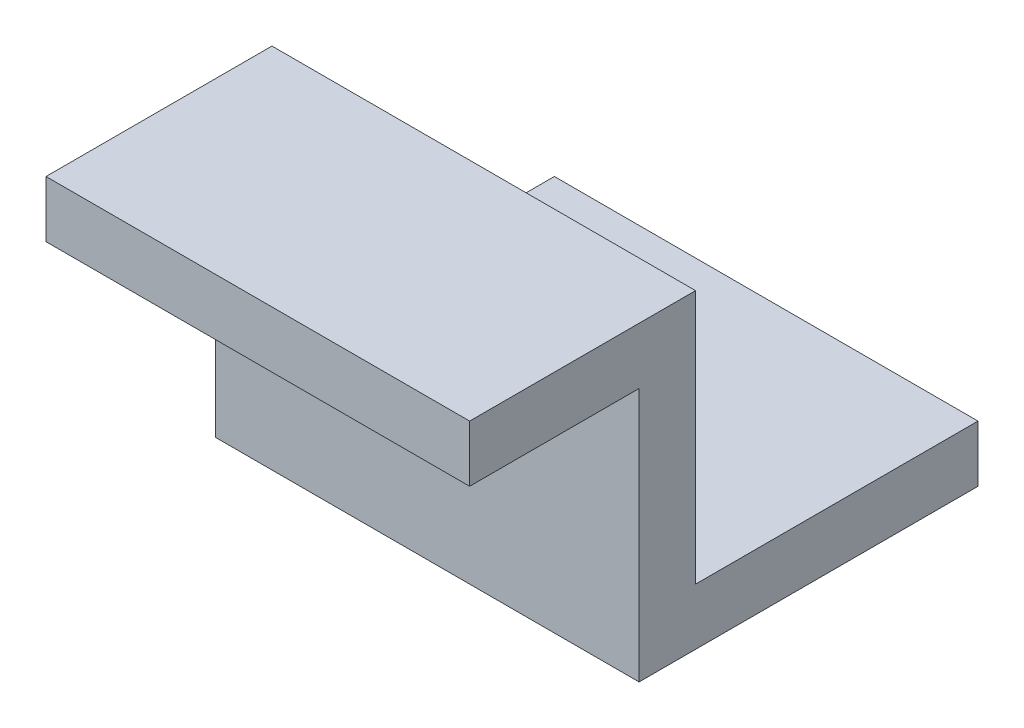
ISO-10303-21;
HEADER;
FILE_DESCRIPTION(('STEP AP214'),'2;1');
FILE_NAME('part.step','',(''),(''),'','','');
FILE_SCHEMA(('AUTOMOTIVE_DESIGN { 1 0 10303 214 1 1 1 1 }'));
ENDSEC;
DATA;
#1=APPLICATION_CONTEXT('core data for automotive mechanical design processes');
#2=APPLICATION_PROTOCOL_DEFINITION('international standard','automotive_design',2000,#1);
#3=PRODUCT_CONTEXT('',#1,'mechanical');
#4=PRODUCT('Part','Part','',(#3));
#5=PRODUCT_RELATED_PRODUCT_CATEGORY('part','',(#4));
#6=PRODUCT_DEFINITION_FORMATION('','',#4);
#7=PRODUCT_DEFINITION_CONTEXT('part definition',#1,'design');
#8=PRODUCT_DEFINITION('design','',#6,#7);
#9=PRODUCT_DEFINITION_SHAPE('','',#8);
#10=(LENGTH_UNIT() NAMED_UNIT(*) SI_UNIT(.MILLI.,.METRE.));
#11=(NAMED_UNIT(*) PLANE_ANGLE_UNIT() SI_UNIT($,.RADIAN.));
#12=(NAMED_UNIT(*) SI_UNIT($,.STERADIAN.) SOLID_ANGLE_UNIT());
#13=UNCERTAINTY_MEASURE_WITH_UNIT(LENGTH_MEASURE(1.E-05),#10,'distance_accuracy_value','');
#14=(GEOMETRIC_REPRESENTATION_CONTEXT(3) GLOBAL_UNCERTAINTY_ASSIGNED_CONTEXT((#13)) GLOBAL_UNIT_ASSIGNED_CONTEXT((#10,
#11,#12)) REPRESENTATION_CONTEXT('',''));
#15=CARTESIAN_POINT('',(0.,0.,0.));
#16=DIRECTION('',(0.,0.,1.));
#17=DIRECTION('',(1.,0.,0.));
#18=AXIS2_PLACEMENT_3D('',#15,#16,#17);
#19=CARTESIAN_POINT('',(-15.,-2.,0.));
#20=DIRECTION('',(0.,0.,1.));
#21=DIRECTION('',(1.,0.,0.));
#22=AXIS2_PLACEMENT_3D('',#19,#20,#21);
#23=PLANE('',#22);
#24=DIRECTION('',(0.,-1.,0.));
#25=VECTOR('',#24,1.);
#26=CARTESIAN_POINT('',(0.,-2.,0.));
#27=LINE('',#26,#25);
#28=CARTESIAN_POINT('',(0.,0.,0.));
#29=VERTEX_POINT('',#28);
#30=CARTESIAN_POINT('',(0.,-2.,0.));
#31=VERTEX_POINT('',#30);
#32=EDGE_CURVE('E130',#29,#31,#27,.T.);
#33=ORIENTED_EDGE('',*,*,#32,.F.);
#34=DIRECTION('',(1.,0.,0.));
#35=VECTOR('',#34,1.);
#36=CARTESIAN_POINT('',(-15.,0.,0.));
#37=LINE('',#36,#35);
#38=CARTESIAN_POINT('',(-15.,0.,0.));
#39=VERTEX_POINT('',#38);
#40=EDGE_CURVE('E11',#39,#29,#37,.T.);
#41=ORIENTED_EDGE('',*,*,#40,.F.);
#42=DIRECTION('',(0.,-1.,0.));
#43=VECTOR('',#42,1.);
#44=CARTESIAN_POINT('',(-15.,-2.,0.));
#45=LINE('',#44,#43);
#46=CARTESIAN_POINT('',(-15.,-2.,0.));
#47=VERTEX_POINT('',#46);
#48=EDGE_CURVE('E151',#39,#47,#45,.T.);
#49=ORIENTED_EDGE('',*,*,#48,.T.);
#50=DIRECTION('',(1.,0.,0.));
#51=VECTOR('',#50,1.);
#52=CARTESIAN_POINT('',(-15.,-2.,0.));
#53=LINE('',#52,#51);
#54=EDGE_CURVE('E36',#47,#31,#53,.T.);
#55=ORIENTED_EDGE('',*,*,#54,.T.);
#56=EDGE_LOOP('',(#33,#41,#49,#55));
#57=FACE_BOUND('',#56,.T.);
#58=ADVANCED_FACE('F33',(#57),#23,.T.);
#59=CARTESIAN_POINT('',(-15.,0.,0.));
#60=DIRECTION('',(0.,1.,0.));
#61=DIRECTION('',(0.,0.,1.));
#62=AXIS2_PLACEMENT_3D('',#59,#60,#61);
#63=PLANE('',#62);
#64=DIRECTION('',(0.,0.,1.));
#65=VECTOR('',#64,1.);
#66=CARTESIAN_POINT('',(0.,0.,0.));
#67=LINE('',#66,#65);
#68=CARTESIAN_POINT('',(0.,0.,-8.));
#69=VERTEX_POINT('',#68);
#70=EDGE_CURVE('E149',#69,#29,#67,.T.);
#71=ORIENTED_EDGE('',*,*,#70,.F.);
#72=DIRECTION('',(1.,0.,0.));
#73=VECTOR('',#72,1.);
#74=CARTESIAN_POINT('',(-15.,0.,-8.));
#75=LINE('',#74,#73);
#76=CARTESIAN_POINT('',(-15.,0.,-8.));
#77=VERTEX_POINT('',#76);
#78=EDGE_CURVE('E42',#77,#69,#75,.T.);
#79=ORIENTED_EDGE('',*,*,#78,.F.);
#80=DIRECTION('',(0.,0.,1.));
#81=VECTOR('',#80,1.);
#82=CARTESIAN_POINT('',(-15.,0.,0.));
#83=LINE('',#82,#81);
#84=EDGE_CURVE('E120',#77,#39,#83,.T.);
#85=ORIENTED_EDGE('',*,*,#84,.T.);
#86=ORIENTED_EDGE('',*,*,#40,.T.);
#87=EDGE_LOOP('',(#71,#79,#85,#86));
#88=FACE_BOUND('',#87,.T.);
#89=ADVANCED_FACE('F163',(#88),#63,.T.);
#90=CARTESIAN_POINT('',(-15.,0.,-8.));
#91=DIRECTION('',(0.,0.,-1.));
#92=DIRECTION('',(0.,1.,0.));
#93=AXIS2_PLACEMENT_3D('',#90,#91,#92);
#94=PLANE('',#93);
#95=DIRECTION('',(0.,1.,0.));
#96=VECTOR('',#95,1.);
#97=CARTESIAN_POINT('',(0.,0.,-8.));
#98=LINE('',#97,#96);
#99=CARTESIAN_POINT('',(0.,-9.,-8.));
#100=VERTEX_POINT('',#99);
#101=EDGE_CURVE('E107',#100,#69,#98,.T.);
#102=ORIENTED_EDGE('',*,*,#101,.F.);
#103=DIRECTION('',(1.,0.,0.));
#104=VECTOR('',#103,1.);
#105=CARTESIAN_POINT('',(-15.,-9.,-8.));
#106=LINE('',#105,#104);
#107=CARTESIAN_POINT('',(-15.,-9.,-8.));
#108=VERTEX_POINT('',#107);
#109=EDGE_CURVE('E102',#108,#100,#106,.T.);
#110=ORIENTED_EDGE('',*,*,#109,.F.);
#111=DIRECTION('',(0.,1.,0.));
#112=VECTOR('',#111,1.);
#113=CARTESIAN_POINT('',(-15.,0.,-8.));
#114=LINE('',#113,#112);
#115=EDGE_CURVE('E105',#108,#77,#114,.T.);
#116=ORIENTED_EDGE('',*,*,#115,.T.);
#117=ORIENTED_EDGE('',*,*,#78,.T.);
#118=EDGE_LOOP('',(#102,#110,#116,#117));
#119=FACE_BOUND('',#118,.T.);
#120=ADVANCED_FACE('F104',(#119),#94,.T.);
#121=CARTESIAN_POINT('',(-15.,-9.,-8.));
#122=DIRECTION('',(0.,1.,0.));
#123=DIRECTION('',(0.,0.,1.));
#124=AXIS2_PLACEMENT_3D('',#121,#122,#123);
#125=PLANE('',#124);
#126=CARTESIAN_POINT('',(-7.5,-9.,-13.));
#127=DIRECTION('',(0.,1.,0.));
#128=DIRECTION('',(0.,0.,1.));
#129=AXIS2_PLACEMENT_3D('',#126,#127,#128);
#130=CIRCLE('',#129,1.5);
#131=CARTESIAN_POINT('',(-7.5,-9.,-11.5));
#132=VERTEX_POINT('',#131);
#133=EDGE_CURVE('E134',#132,#132,#130,.T.);
#134=ORIENTED_EDGE('',*,*,#133,.F.);
#135=EDGE_LOOP('',(#134));
#136=FACE_BOUND('',#135,.T.);
#137=DIRECTION('',(0.,0.,1.));
#138=VECTOR('',#137,1.);
#139=CARTESIAN_POINT('',(0.,-9.,-8.));
#140=LINE('',#139,#138);
#141=CARTESIAN_POINT('',(0.,-9.,-18.));
#142=VERTEX_POINT('',#141);
#143=EDGE_CURVE('E146',#142,#100,#140,.T.);
#144=ORIENTED_EDGE('',*,*,#143,.F.);
#145=DIRECTION('',(1.,0.,0.));
#146=VECTOR('',#145,1.);
#147=CARTESIAN_POINT('',(-15.,-9.,-18.));
#148=LINE('',#147,#146);
#149=CARTESIAN_POINT('',(-15.,-9.,-18.));
#150=VERTEX_POINT('',#149);
#151=EDGE_CURVE('E112',#150,#142,#148,.T.);
#152=ORIENTED_EDGE('',*,*,#151,.F.);
#153=DIRECTION('',(0.,0.,1.));
#154=VECTOR('',#153,1.);
#155=CARTESIAN_POINT('',(-15.,-9.,-8.));
#156=LINE('',#155,#154);
#157=EDGE_CURVE('E118',#150,#108,#156,.T.);
#158=ORIENTED_EDGE('',*,*,#157,.T.);
#159=ORIENTED_EDGE('',*,*,#109,.T.);
#160=EDGE_LOOP('',(#144,#152,#158,#159));
#161=FACE_BOUND('',#160,.T.);
#162=ADVANCED_FACE('F122',(#136,#161),#125,.T.);
#163=CARTESIAN_POINT('',(-15.,-9.,-18.));
#164=DIRECTION('',(0.,0.,-1.));
#165=DIRECTION('',(-1.,0.,0.));
#166=AXIS2_PLACEMENT_3D('',#163,#164,#165);
#167=PLANE('',#166);
#168=DIRECTION('',(0.,1.,0.));
#169=VECTOR('',#168,1.);
#170=CARTESIAN_POINT('',(0.,-9.,-18.));
#171=LINE('',#170,#169);
#172=CARTESIAN_POINT('',(0.,-11.,-18.));
#173=VERTEX_POINT('',#172);
#174=EDGE_CURVE('E143',#173,#142,#171,.T.);
#175=ORIENTED_EDGE('',*,*,#174,.F.);
#176=DIRECTION('',(1.,0.,0.));
#177=VECTOR('',#176,1.);
#178=CARTESIAN_POINT('',(-15.,-11.,-18.));
#179=LINE('',#178,#177);
#180=CARTESIAN_POINT('',(-15.,-11.,-18.));
#181=VERTEX_POINT('',#180);
#182=EDGE_CURVE('E155',#181,#173,#179,.T.);
#183=ORIENTED_EDGE('',*,*,#182,.F.);
#184=DIRECTION('',(0.,1.,0.));
#185=VECTOR('',#184,1.);
#186=CARTESIAN_POINT('',(-15.,-9.,-18.));
#187=LINE('',#186,#185);
#188=EDGE_CURVE('E123',#181,#150,#187,.T.);
#189=ORIENTED_EDGE('',*,*,#188,.T.);
#190=ORIENTED_EDGE('',*,*,#151,.T.);
#191=EDGE_LOOP('',(#175,#183,#189,#190));
#192=FACE_BOUND('',#191,.T.);
#193=ADVANCED_FACE('F176',(#192),#167,.T.);
#194=CARTESIAN_POINT('',(-15.,-11.,-18.));
#195=DIRECTION('',(0.,-1.,0.));
#196=DIRECTION('',(0.,0.,-1.));
#197=AXIS2_PLACEMENT_3D('',#194,#195,#196);
#198=PLANE('',#197);
#199=CARTESIAN_POINT('',(-7.5,-11.,-13.));
#200=DIRECTION('',(0.,-1.,0.));
#201=DIRECTION('',(0.,0.,-1.));
#202=AXIS2_PLACEMENT_3D('',#199,#200,#201);
#203=CIRCLE('',#202,1.5);
#204=CARTESIAN_POINT('',(-7.5,-11.,-14.5));
#205=VERTEX_POINT('',#204);
#206=EDGE_CURVE('E204',#205,#205,#203,.F.);
#207=ORIENTED_EDGE('',*,*,#206,.T.);
#208=EDGE_LOOP('',(#207));
#209=FACE_BOUND('',#208,.T.);
#210=DIRECTION('',(0.,0.,-1.));
#211=VECTOR('',#210,1.);
#212=CARTESIAN_POINT('',(0.,-11.,-18.));
#213=LINE('',#212,#211);
#214=CARTESIAN_POINT('',(0.,-11.,-6.));
#215=VERTEX_POINT('',#214);
#216=EDGE_CURVE('E140',#215,#173,#213,.T.);
#217=ORIENTED_EDGE('',*,*,#216,.F.);
#218=DIRECTION('',(1.,0.,0.));
#219=VECTOR('',#218,1.);
#220=CARTESIAN_POINT('',(-15.,-11.,-6.));
#221=LINE('',#220,#219);
#222=CARTESIAN_POINT('',(-15.,-11.,-6.));
#223=VERTEX_POINT('',#222);
#224=EDGE_CURVE('E157',#223,#215,#221,.T.);
#225=ORIENTED_EDGE('',*,*,#224,.F.);
#226=DIRECTION('',(0.,0.,-1.));
#227=VECTOR('',#226,1.);
#228=CARTESIAN_POINT('',(-15.,-11.,-18.));
#229=LINE('',#228,#227);
#230=EDGE_CURVE('E125',#223,#181,#229,.T.);
#231=ORIENTED_EDGE('',*,*,#230,.T.);
#232=ORIENTED_EDGE('',*,*,#182,.T.);
#233=EDGE_LOOP('',(#217,#225,#231,#232));
#234=FACE_BOUND('',#233,.T.);
#235=ADVANCED_FACE('F180',(#209,#234),#198,.T.);
#236=CARTESIAN_POINT('',(-15.,-11.,-6.));
#237=DIRECTION('',(0.,0.,1.));
#238=DIRECTION('',(1.,0.,0.));
#239=AXIS2_PLACEMENT_3D('',#236,#237,#238);
#240=PLANE('',#239);
#241=DIRECTION('',(0.,-1.,0.));
#242=VECTOR('',#241,1.);
#243=CARTESIAN_POINT('',(0.,-11.,-6.));
#244=LINE('',#243,#242);
#245=CARTESIAN_POINT('',(0.,-2.,-6.));
#246=VERTEX_POINT('',#245);
#247=EDGE_CURVE('E137',#246,#215,#244,.T.);
#248=ORIENTED_EDGE('',*,*,#247,.F.);
#249=DIRECTION('',(1.,0.,0.));
#250=VECTOR('',#249,1.);
#251=CARTESIAN_POINT('',(-15.,-2.,-6.));
#252=LINE('',#251,#250);
#253=CARTESIAN_POINT('',(-15.,-2.,-6.));
#254=VERTEX_POINT('',#253);
#255=EDGE_CURVE('E158',#254,#246,#252,.T.);
#256=ORIENTED_EDGE('',*,*,#255,.F.);
#257=DIRECTION('',(0.,-1.,0.));
#258=VECTOR('',#257,1.);
#259=CARTESIAN_POINT('',(-15.,-11.,-6.));
#260=LINE('',#259,#258);
#261=EDGE_CURVE('E213',#254,#223,#260,.T.);
#262=ORIENTED_EDGE('',*,*,#261,.T.);
#263=ORIENTED_EDGE('',*,*,#224,.T.);
#264=EDGE_LOOP('',(#248,#256,#262,#263));
#265=FACE_BOUND('',#264,.T.);
#266=ADVANCED_FACE('F184',(#265),#240,.T.);
#267=CARTESIAN_POINT('',(-15.,-2.,-6.));
#268=DIRECTION('',(0.,-1.,0.));
#269=DIRECTION('',(0.,0.,-1.));
#270=AXIS2_PLACEMENT_3D('',#267,#268,#269);
#271=PLANE('',#270);
#272=DIRECTION('',(0.,0.,-1.));
#273=VECTOR('',#272,1.);
#274=CARTESIAN_POINT('',(0.,-2.,-6.));
#275=LINE('',#274,#273);
#276=EDGE_CURVE('E133',#31,#246,#275,.T.);
#277=ORIENTED_EDGE('',*,*,#276,.F.);
#278=ORIENTED_EDGE('',*,*,#54,.F.);
#279=DIRECTION('',(0.,0.,-1.));
#280=VECTOR('',#279,1.);
#281=CARTESIAN_POINT('',(-15.,-2.,-6.));
#282=LINE('',#281,#280);
#283=EDGE_CURVE('E211',#47,#254,#282,.T.);
#284=ORIENTED_EDGE('',*,*,#283,.T.);
#285=ORIENTED_EDGE('',*,*,#255,.T.);
#286=EDGE_LOOP('',(#277,#278,#284,#285));
#287=FACE_BOUND('',#286,.T.);
#288=ADVANCED_FACE('F160',(#287),#271,.T.);
#289=CARTESIAN_POINT('',(-15.,0.,0.));
#290=DIRECTION('',(-1.,0.,0.));
#291=DIRECTION('',(0.,0.,1.));
#292=AXIS2_PLACEMENT_3D('',#289,#290,#291);
#293=PLANE('',#292);
#294=ORIENTED_EDGE('',*,*,#48,.F.);
#295=ORIENTED_EDGE('',*,*,#84,.F.);
#296=ORIENTED_EDGE('',*,*,#115,.F.);
#297=ORIENTED_EDGE('',*,*,#157,.F.);
#298=ORIENTED_EDGE('',*,*,#188,.F.);
#299=ORIENTED_EDGE('',*,*,#230,.F.);
#300=ORIENTED_EDGE('',*,*,#261,.F.);
#301=ORIENTED_EDGE('',*,*,#283,.F.);
#302=EDGE_LOOP('',(#294,#295,#296,#297,#298,#299,#300,#301));
#303=FACE_BOUND('',#302,.T.);
#304=ADVANCED_FACE('F116',(#303),#293,.T.);
#305=CARTESIAN_POINT('',(0.,0.,0.));
#306=DIRECTION('',(-1.,0.,0.));
#307=DIRECTION('',(0.,0.,1.));
#308=AXIS2_PLACEMENT_3D('',#305,#306,#307);
#309=PLANE('',#308);
#310=ORIENTED_EDGE('',*,*,#32,.T.);
#311=ORIENTED_EDGE('',*,*,#276,.T.);
#312=ORIENTED_EDGE('',*,*,#247,.T.);
#313=ORIENTED_EDGE('',*,*,#216,.T.);
#314=ORIENTED_EDGE('',*,*,#174,.T.);
#315=ORIENTED_EDGE('',*,*,#143,.T.);
#316=ORIENTED_EDGE('',*,*,#101,.T.);
#317=ORIENTED_EDGE('',*,*,#70,.T.);
#318=EDGE_LOOP('',(#310,#311,#312,#313,#314,#315,#316,#317));
#319=FACE_BOUND('',#318,.T.);
#320=ADVANCED_FACE('F162',(#319),#309,.F.);
#321=CARTESIAN_POINT('',(-7.5,-11.001,-13.));
#322=DIRECTION('',(0.,1.,0.));
#323=DIRECTION('',(0.,0.,1.));
#324=AXIS2_PLACEMENT_3D('',#321,#322,#323);
#325=CYLINDRICAL_SURFACE('',#324,1.5);
#326=ORIENTED_EDGE('',*,*,#206,.F.);
#327=EDGE_LOOP('',(#326));
#328=FACE_BOUND('',#327,.T.);
#329=ORIENTED_EDGE('',*,*,#133,.T.);
#330=EDGE_LOOP('',(#329));
#331=FACE_BOUND('',#330,.T.);
#332=ADVANCED_FACE('F195',(#328,#331),#325,.F.);
#333=CLOSED_SHELL('',(#58,#89,#120,#162,#193,#235,#266,#288,#304,#320,#332));
#334=MANIFOLD_SOLID_BREP('B2',#333);
#335=ADVANCED_BREP_SHAPE_REPRESENTATION('',(#18,#334),#14);
#336=SHAPE_DEFINITION_REPRESENTATION(#9,#335);
ENDSEC;
END-ISO-10303-21;
